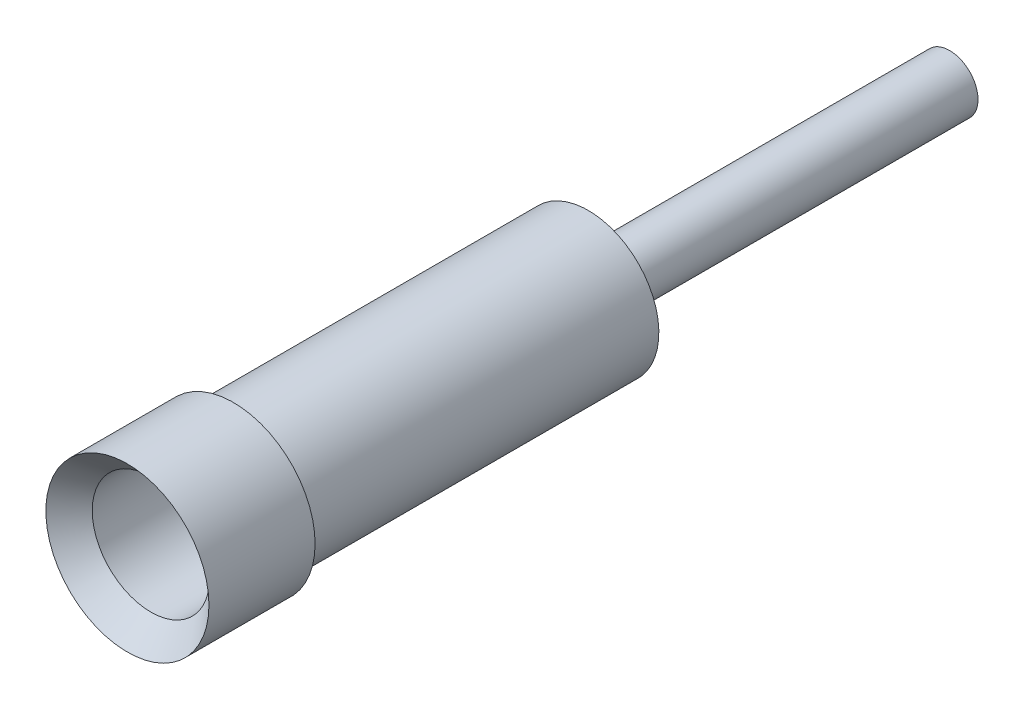
ISO-10303-21;
HEADER;
FILE_DESCRIPTION(('STEP AP214'),'2;1');
FILE_NAME('part.step','',(''),(''),'','','');
FILE_SCHEMA(('AUTOMOTIVE_DESIGN { 1 0 10303 214 1 1 1 1 }'));
ENDSEC;
DATA;
#1=APPLICATION_CONTEXT('core data for automotive mechanical design processes');
#2=APPLICATION_PROTOCOL_DEFINITION('international standard','automotive_design',2000,#1);
#3=PRODUCT_CONTEXT('',#1,'mechanical');
#4=PRODUCT('Part','Part','',(#3));
#5=PRODUCT_RELATED_PRODUCT_CATEGORY('part','',(#4));
#6=PRODUCT_DEFINITION_FORMATION('','',#4);
#7=PRODUCT_DEFINITION_CONTEXT('part definition',#1,'design');
#8=PRODUCT_DEFINITION('design','',#6,#7);
#9=PRODUCT_DEFINITION_SHAPE('','',#8);
#10=(LENGTH_UNIT() NAMED_UNIT(*) SI_UNIT(.MILLI.,.METRE.));
#11=(NAMED_UNIT(*) PLANE_ANGLE_UNIT() SI_UNIT($,.RADIAN.));
#12=(NAMED_UNIT(*) SI_UNIT($,.STERADIAN.) SOLID_ANGLE_UNIT());
#13=UNCERTAINTY_MEASURE_WITH_UNIT(LENGTH_MEASURE(1.E-05),#10,'distance_accuracy_value','');
#14=(GEOMETRIC_REPRESENTATION_CONTEXT(3) GLOBAL_UNCERTAINTY_ASSIGNED_CONTEXT((#13)) GLOBAL_UNIT_ASSIGNED_CONTEXT((#10,
#11,#12)) REPRESENTATION_CONTEXT('',''));
#15=CARTESIAN_POINT('',(0.,0.,0.));
#16=DIRECTION('',(0.,0.,1.));
#17=DIRECTION('',(1.,0.,0.));
#18=AXIS2_PLACEMENT_3D('',#15,#16,#17);
#19=CARTESIAN_POINT('',(3.208854684081,3.235452,-1.016));
#20=DIRECTION('',(0.,0.,-1.));
#21=DIRECTION('',(0.,1.,0.));
#22=AXIS2_PLACEMENT_3D('',#19,#20,#21);
#23=PLANE('',#22);
#24=CARTESIAN_POINT('',(3.7846,3.81,-1.01600000000037));
#25=DIRECTION('',(0.,0.,-1.));
#26=DIRECTION('',(-1.,0.,0.));
#27=AXIS2_PLACEMENT_3D('',#24,#25,#26);
#28=CIRCLE('',#27,0.55245);
#29=CARTESIAN_POINT('',(3.23215,3.81,-1.01600000000037));
#30=VERTEX_POINT('',#29);
#31=EDGE_CURVE('E51',#30,#30,#28,.T.);
#32=ORIENTED_EDGE('',*,*,#31,.F.);
#33=EDGE_LOOP('',(#32));
#34=FACE_BOUND('',#33,.T.);
#35=ADVANCED_FACE('F30',(#34),#23,.F.);
#36=CARTESIAN_POINT('',(3.7846,3.81,-0.221239404938666));
#37=DIRECTION('',(0.,0.,-1.));
#38=DIRECTION('',(-1.,0.,0.));
#39=AXIS2_PLACEMENT_3D('',#36,#37,#38);
#40=CYLINDRICAL_SURFACE('',#39,0.55245);
#41=CARTESIAN_POINT('',(3.7846,3.81,-0.221239404938627));
#42=DIRECTION('',(0.,0.,-1.));
#43=DIRECTION('',(0.,1.,0.));
#44=AXIS2_PLACEMENT_3D('',#41,#42,#43);
#45=CIRCLE('',#44,0.552450000000346);
#46=CARTESIAN_POINT('',(3.7846,4.36245000000035,-0.221239404938627));
#47=VERTEX_POINT('',#46);
#48=EDGE_CURVE('E47',#47,#47,#45,.T.);
#49=ORIENTED_EDGE('',*,*,#48,.F.);
#50=EDGE_LOOP('',(#49));
#51=FACE_BOUND('',#50,.T.);
#52=ORIENTED_EDGE('',*,*,#31,.T.);
#53=EDGE_LOOP('',(#52));
#54=FACE_BOUND('',#53,.T.);
#55=ADVANCED_FACE('F67',(#51,#54),#40,.F.);
#56=CARTESIAN_POINT('',(3.7846,3.81,0.));
#57=DIRECTION('',(0.,0.,1.));
#58=DIRECTION('',(1.,0.,0.));
#59=AXIS2_PLACEMENT_3D('',#56,#57,#58);
#60=CONICAL_SURFACE('',#59,0.76834999999965,0.773184349290432);
#61=ORIENTED_EDGE('',*,*,#48,.T.);
#62=EDGE_LOOP('',(#61));
#63=FACE_BOUND('',#62,.T.);
#64=CARTESIAN_POINT('',(3.7846,3.81,0.));
#65=DIRECTION('',(0.,0.,1.));
#66=DIRECTION('',(1.,0.,0.));
#67=AXIS2_PLACEMENT_3D('',#64,#65,#66);
#68=CIRCLE('',#67,0.76834999999965);
#69=CARTESIAN_POINT('',(4.55294999999965,3.81,0.));
#70=VERTEX_POINT('',#69);
#71=EDGE_CURVE('E50',#70,#70,#68,.T.);
#72=ORIENTED_EDGE('',*,*,#71,.T.);
#73=EDGE_LOOP('',(#72));
#74=FACE_BOUND('',#73,.T.);
#75=ADVANCED_FACE('F74',(#63,#74),#60,.F.);
#76=CARTESIAN_POINT('',(3.7846,3.81,-1.));
#77=DIRECTION('',(0.,0.,1.));
#78=DIRECTION('',(1.,0.,0.));
#79=AXIS2_PLACEMENT_3D('',#76,#77,#78);
#80=CYLINDRICAL_SURFACE('',#79,0.76834999999965);
#81=CARTESIAN_POINT('',(3.7846,3.81,-1.));
#82=DIRECTION('',(0.,0.,1.));
#83=DIRECTION('',(1.,0.,0.));
#84=AXIS2_PLACEMENT_3D('',#81,#82,#83);
#85=CIRCLE('',#84,0.76834999999965);
#86=CARTESIAN_POINT('',(4.55294999999965,3.81,-1.));
#87=VERTEX_POINT('',#86);
#88=EDGE_CURVE('E53',#87,#87,#85,.F.);
#89=ORIENTED_EDGE('',*,*,#88,.F.);
#90=EDGE_LOOP('',(#89));
#91=FACE_BOUND('',#90,.T.);
#92=ORIENTED_EDGE('',*,*,#71,.F.);
#93=EDGE_LOOP('',(#92));
#94=FACE_BOUND('',#93,.T.);
#95=ADVANCED_FACE('F91',(#91,#94),#80,.T.);
#96=CARTESIAN_POINT('',(0.,0.,-1.));
#97=DIRECTION('',(0.,0.,1.));
#98=DIRECTION('',(1.,0.,0.));
#99=AXIS2_PLACEMENT_3D('',#96,#97,#98);
#100=PLANE('',#99);
#101=ORIENTED_EDGE('',*,*,#88,.T.);
#102=EDGE_LOOP('',(#101));
#103=FACE_BOUND('',#102,.T.);
#104=CARTESIAN_POINT('',(3.7846,3.81,-0.999999999999999));
#105=DIRECTION('',(0.,0.,1.));
#106=DIRECTION('',(1.,0.,0.));
#107=AXIS2_PLACEMENT_3D('',#104,#105,#106);
#108=CIRCLE('',#107,0.664844999999999);
#109=CARTESIAN_POINT('',(4.449445,3.81,-0.999999999999999));
#110=VERTEX_POINT('',#109);
#111=EDGE_CURVE('E34',#110,#110,#108,.F.);
#112=ORIENTED_EDGE('',*,*,#111,.F.);
#113=EDGE_LOOP('',(#112));
#114=FACE_BOUND('',#113,.T.);
#115=ADVANCED_FACE('F94',(#103,#114),#100,.F.);
#116=CARTESIAN_POINT('',(3.7846,3.81,13.6329479709105));
#117=DIRECTION('',(0.,0.,-1.));
#118=DIRECTION('',(-1.,0.,0.));
#119=AXIS2_PLACEMENT_3D('',#116,#117,#118);
#120=CYLINDRICAL_SURFACE('',#119,0.664844999999999);
#121=ORIENTED_EDGE('',*,*,#111,.T.);
#122=EDGE_LOOP('',(#121));
#123=FACE_BOUND('',#122,.T.);
#124=CARTESIAN_POINT('',(3.7846,3.81,-4.34213087707354));
#125=DIRECTION('',(0.,0.,1.));
#126=DIRECTION('',(0.,-1.,0.));
#127=AXIS2_PLACEMENT_3D('',#124,#125,#126);
#128=CIRCLE('',#127,0.664845);
#129=CARTESIAN_POINT('',(3.7846,3.145155,-4.34213087707354));
#130=VERTEX_POINT('',#129);
#131=EDGE_CURVE('E11',#130,#130,#128,.F.);
#132=ORIENTED_EDGE('',*,*,#131,.F.);
#133=EDGE_LOOP('',(#132));
#134=FACE_BOUND('',#133,.T.);
#135=ADVANCED_FACE('F32',(#123,#134),#120,.T.);
#136=CARTESIAN_POINT('',(3.498463006524,4.096136993476,-7.747));
#137=DIRECTION('',(0.,0.,1.));
#138=DIRECTION('',(0.,-1.,0.));
#139=AXIS2_PLACEMENT_3D('',#136,#137,#138);
#140=PLANE('',#139);
#141=CARTESIAN_POINT('',(3.7846,3.81,-7.747));
#142=DIRECTION('',(0.,0.,1.));
#143=DIRECTION('',(1.,0.,0.));
#144=AXIS2_PLACEMENT_3D('',#141,#142,#143);
#145=CIRCLE('',#144,0.266699999999999);
#146=CARTESIAN_POINT('',(4.0513,3.81,-7.747));
#147=VERTEX_POINT('',#146);
#148=EDGE_CURVE('E43',#147,#147,#145,.F.);
#149=ORIENTED_EDGE('',*,*,#148,.T.);
#150=EDGE_LOOP('',(#149));
#151=FACE_BOUND('',#150,.T.);
#152=ADVANCED_FACE('F78',(#151),#140,.F.);
#153=CARTESIAN_POINT('',(3.7846,3.81,-7.747));
#154=DIRECTION('',(0.,0.,1.));
#155=DIRECTION('',(1.,0.,0.));
#156=AXIS2_PLACEMENT_3D('',#153,#154,#155);
#157=CYLINDRICAL_SURFACE('',#156,0.266699999999999);
#158=ORIENTED_EDGE('',*,*,#148,.F.);
#159=EDGE_LOOP('',(#158));
#160=FACE_BOUND('',#159,.T.);
#161=CARTESIAN_POINT('',(3.7846,3.81,-4.57200000000018));
#162=DIRECTION('',(0.,0.,1.));
#163=DIRECTION('',(0.,-1.,0.));
#164=AXIS2_PLACEMENT_3D('',#161,#162,#163);
#165=CIRCLE('',#164,0.266700000000103);
#166=CARTESIAN_POINT('',(3.7846,3.5432999999999,-4.57200000000018));
#167=VERTEX_POINT('',#166);
#168=EDGE_CURVE('E38',#167,#167,#165,.F.);
#169=ORIENTED_EDGE('',*,*,#168,.T.);
#170=EDGE_LOOP('',(#169));
#171=FACE_BOUND('',#170,.T.);
#172=ADVANCED_FACE('F81',(#160,#171),#157,.T.);
#173=CARTESIAN_POINT('',(3.7846,3.81,-4.57200000000018));
#174=DIRECTION('',(0.,0.,1.));
#175=DIRECTION('',(1.,0.,0.));
#176=AXIS2_PLACEMENT_3D('',#173,#174,#175);
#177=CONICAL_SURFACE('',#176,0.266700000000102,1.04719755119665);
#178=ORIENTED_EDGE('',*,*,#168,.F.);
#179=EDGE_LOOP('',(#178));
#180=FACE_BOUND('',#179,.T.);
#181=ORIENTED_EDGE('',*,*,#131,.T.);
#182=EDGE_LOOP('',(#181));
#183=FACE_BOUND('',#182,.T.);
#184=ADVANCED_FACE('F84',(#180,#183),#177,.T.);
#185=CLOSED_SHELL('',(#35,#55,#75,#95,#115,#135,#152,#172,#184));
#186=MANIFOLD_SOLID_BREP('B2',#185);
#187=ADVANCED_BREP_SHAPE_REPRESENTATION('',(#18,#186),#14);
#188=SHAPE_DEFINITION_REPRESENTATION(#9,#187);
ENDSEC;
END-ISO-10303-21;
